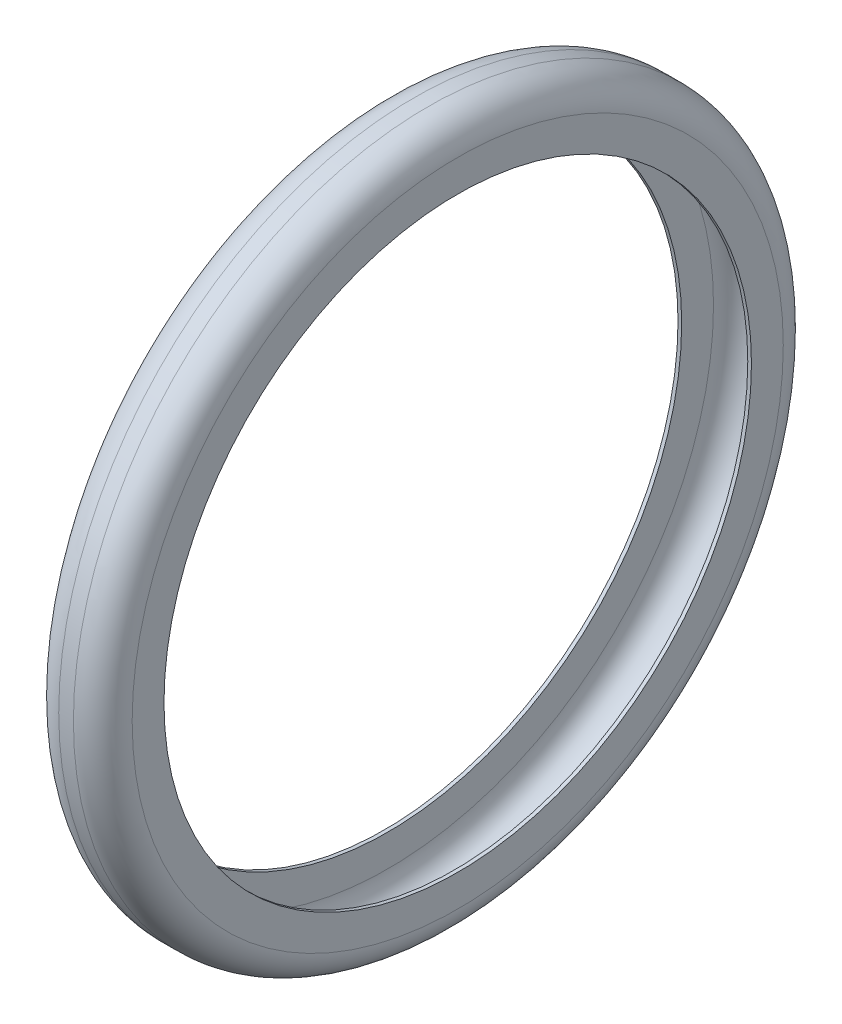
ISO-10303-21;
HEADER;
FILE_DESCRIPTION(('STEP AP214'),'2;1');
FILE_NAME('part.step','',(''),(''),'','','');
FILE_SCHEMA(('AUTOMOTIVE_DESIGN { 1 0 10303 214 1 1 1 1 }'));
ENDSEC;
DATA;
#1=APPLICATION_CONTEXT('core data for automotive mechanical design processes');
#2=APPLICATION_PROTOCOL_DEFINITION('international standard','automotive_design',2000,#1);
#3=PRODUCT_CONTEXT('',#1,'mechanical');
#4=PRODUCT('Part','Part','',(#3));
#5=PRODUCT_RELATED_PRODUCT_CATEGORY('part','',(#4));
#6=PRODUCT_DEFINITION_FORMATION('','',#4);
#7=PRODUCT_DEFINITION_CONTEXT('part definition',#1,'design');
#8=PRODUCT_DEFINITION('design','',#6,#7);
#9=PRODUCT_DEFINITION_SHAPE('','',#8);
#10=(LENGTH_UNIT() NAMED_UNIT(*) SI_UNIT(.MILLI.,.METRE.));
#11=(NAMED_UNIT(*) PLANE_ANGLE_UNIT() SI_UNIT($,.RADIAN.));
#12=(NAMED_UNIT(*) SI_UNIT($,.STERADIAN.) SOLID_ANGLE_UNIT());
#13=UNCERTAINTY_MEASURE_WITH_UNIT(LENGTH_MEASURE(1.E-05),#10,'distance_accuracy_value','');
#14=(GEOMETRIC_REPRESENTATION_CONTEXT(3) GLOBAL_UNCERTAINTY_ASSIGNED_CONTEXT((#13)) GLOBAL_UNIT_ASSIGNED_CONTEXT((#10,
#11,#12)) REPRESENTATION_CONTEXT('',''));
#15=CARTESIAN_POINT('',(0.,0.,0.));
#16=DIRECTION('',(0.,0.,1.));
#17=DIRECTION('',(1.,0.,0.));
#18=AXIS2_PLACEMENT_3D('',#15,#16,#17);
#19=CARTESIAN_POINT('',(60.,0.,0.));
#20=DIRECTION('',(-1.,0.,0.));
#21=DIRECTION('',(0.,0.,1.));
#22=AXIS2_PLACEMENT_3D('',#19,#20,#21);
#23=CYLINDRICAL_SURFACE('',#22,240.);
#24=CARTESIAN_POINT('',(0.,0.,0.));
#25=DIRECTION('',(1.,0.,0.));
#26=DIRECTION('',(0.,0.,-1.));
#27=AXIS2_PLACEMENT_3D('',#24,#25,#26);
#28=CIRCLE('',#27,240.);
#29=CARTESIAN_POINT('',(0.,0.,-240.));
#30=VERTEX_POINT('',#29);
#31=EDGE_CURVE('E53',#30,#30,#28,.T.);
#32=ORIENTED_EDGE('',*,*,#31,.F.);
#33=EDGE_LOOP('',(#32));
#34=FACE_BOUND('',#33,.T.);
#35=CARTESIAN_POINT('',(3.,0.,0.));
#36=DIRECTION('',(1.,0.,0.));
#37=DIRECTION('',(0.,0.,-1.));
#38=AXIS2_PLACEMENT_3D('',#35,#36,#37);
#39=CIRCLE('',#38,240.);
#40=CARTESIAN_POINT('',(3.,0.,-240.));
#41=VERTEX_POINT('',#40);
#42=EDGE_CURVE('E59',#41,#41,#39,.T.);
#43=ORIENTED_EDGE('',*,*,#42,.T.);
#44=EDGE_LOOP('',(#43));
#45=FACE_BOUND('',#44,.T.);
#46=ADVANCED_FACE('F32',(#34,#45),#23,.F.);
#47=CARTESIAN_POINT('',(60.,0.,0.));
#48=DIRECTION('',(1.,0.,0.));
#49=DIRECTION('',(0.,0.,-1.));
#50=AXIS2_PLACEMENT_3D('',#47,#48,#49);
#51=PLANE('',#50);
#52=CARTESIAN_POINT('',(60.,0.,0.));
#53=DIRECTION('',(1.,0.,0.));
#54=DIRECTION('',(0.,0.,-1.));
#55=AXIS2_PLACEMENT_3D('',#52,#53,#54);
#56=CIRCLE('',#55,266.);
#57=CARTESIAN_POINT('',(60.,0.,-266.));
#58=VERTEX_POINT('',#57);
#59=EDGE_CURVE('E10',#58,#58,#56,.T.);
#60=ORIENTED_EDGE('',*,*,#59,.T.);
#61=EDGE_LOOP('',(#60));
#62=FACE_BOUND('',#61,.T.);
#63=CARTESIAN_POINT('',(60.,0.,0.));
#64=DIRECTION('',(1.,0.,0.));
#65=DIRECTION('',(0.,0.,-1.));
#66=AXIS2_PLACEMENT_3D('',#63,#64,#65);
#67=CIRCLE('',#66,240.);
#68=CARTESIAN_POINT('',(60.,0.,-240.));
#69=VERTEX_POINT('',#68);
#70=EDGE_CURVE('E52',#69,#69,#67,.T.);
#71=ORIENTED_EDGE('',*,*,#70,.F.);
#72=EDGE_LOOP('',(#71));
#73=FACE_BOUND('',#72,.T.);
#74=ADVANCED_FACE('F94',(#62,#73),#51,.T.);
#75=CARTESIAN_POINT('',(0.,0.,0.));
#76=DIRECTION('',(1.,0.,0.));
#77=DIRECTION('',(0.,0.,-1.));
#78=AXIS2_PLACEMENT_3D('',#75,#76,#77);
#79=PLANE('',#78);
#80=CARTESIAN_POINT('',(0.,0.,0.));
#81=DIRECTION('',(1.,0.,0.));
#82=DIRECTION('',(0.,0.,-1.));
#83=AXIS2_PLACEMENT_3D('',#80,#81,#82);
#84=CIRCLE('',#83,266.);
#85=CARTESIAN_POINT('',(0.,0.,-266.));
#86=VERTEX_POINT('',#85);
#87=EDGE_CURVE('E39',#86,#86,#84,.F.);
#88=ORIENTED_EDGE('',*,*,#87,.T.);
#89=EDGE_LOOP('',(#88));
#90=FACE_BOUND('',#89,.T.);
#91=ORIENTED_EDGE('',*,*,#31,.T.);
#92=EDGE_LOOP('',(#91));
#93=FACE_BOUND('',#92,.T.);
#94=ADVANCED_FACE('F96',(#90,#93),#79,.F.);
#95=CARTESIAN_POINT('',(60.,0.,0.));
#96=DIRECTION('',(-1.,0.,0.));
#97=DIRECTION('',(0.,0.,1.));
#98=AXIS2_PLACEMENT_3D('',#95,#96,#97);
#99=CYLINDRICAL_SURFACE('',#98,290.);
#100=CARTESIAN_POINT('',(24.,0.,0.));
#101=DIRECTION('',(1.,0.,0.));
#102=DIRECTION('',(0.,0.,-1.));
#103=AXIS2_PLACEMENT_3D('',#100,#101,#102);
#104=CIRCLE('',#103,290.);
#105=CARTESIAN_POINT('',(24.,0.,-290.));
#106=VERTEX_POINT('',#105);
#107=EDGE_CURVE('E43',#106,#106,#104,.T.);
#108=ORIENTED_EDGE('',*,*,#107,.T.);
#109=EDGE_LOOP('',(#108));
#110=FACE_BOUND('',#109,.T.);
#111=CARTESIAN_POINT('',(36.,0.,0.));
#112=DIRECTION('',(1.,0.,0.));
#113=DIRECTION('',(0.,0.,-1.));
#114=AXIS2_PLACEMENT_3D('',#111,#112,#113);
#115=CIRCLE('',#114,290.);
#116=CARTESIAN_POINT('',(36.,0.,-290.));
#117=VERTEX_POINT('',#116);
#118=EDGE_CURVE('E47',#117,#117,#115,.F.);
#119=ORIENTED_EDGE('',*,*,#118,.T.);
#120=EDGE_LOOP('',(#119));
#121=FACE_BOUND('',#120,.T.);
#122=ADVANCED_FACE('F90',(#110,#121),#99,.T.);
#123=CARTESIAN_POINT('',(57.,0.,0.));
#124=DIRECTION('',(1.,0.,0.));
#125=DIRECTION('',(0.,0.,-1.));
#126=AXIS2_PLACEMENT_3D('',#123,#124,#125);
#127=CIRCLE('',#126,240.);
#128=CARTESIAN_POINT('',(57.,0.,-240.));
#129=VERTEX_POINT('',#128);
#130=EDGE_CURVE('E62',#129,#129,#127,.T.);
#131=ORIENTED_EDGE('',*,*,#130,.F.);
#132=EDGE_LOOP('',(#131));
#133=FACE_BOUND('',#132,.T.);
#134=ORIENTED_EDGE('',*,*,#70,.T.);
#135=EDGE_LOOP('',(#134));
#136=FACE_BOUND('',#135,.T.);
#137=ADVANCED_FACE('F86',(#133,#136),#23,.F.);
#138=CARTESIAN_POINT('',(24.,0.,0.));
#139=DIRECTION('',(1.,0.,0.));
#140=DIRECTION('',(0.,0.,-1.));
#141=AXIS2_PLACEMENT_3D('',#138,#139,#140);
#142=TOROIDAL_SURFACE('',#141,266.,24.);
#143=ORIENTED_EDGE('',*,*,#87,.F.);
#144=EDGE_LOOP('',(#143));
#145=FACE_BOUND('',#144,.T.);
#146=ORIENTED_EDGE('',*,*,#107,.F.);
#147=EDGE_LOOP('',(#146));
#148=FACE_BOUND('',#147,.T.);
#149=ADVANCED_FACE('F89',(#145,#148),#142,.T.);
#150=CARTESIAN_POINT('',(36.,0.,0.));
#151=DIRECTION('',(1.,0.,0.));
#152=DIRECTION('',(0.,0.,-1.));
#153=AXIS2_PLACEMENT_3D('',#150,#151,#152);
#154=TOROIDAL_SURFACE('',#153,266.,24.);
#155=ORIENTED_EDGE('',*,*,#118,.F.);
#156=EDGE_LOOP('',(#155));
#157=FACE_BOUND('',#156,.T.);
#158=ORIENTED_EDGE('',*,*,#59,.F.);
#159=EDGE_LOOP('',(#158));
#160=FACE_BOUND('',#159,.T.);
#161=ADVANCED_FACE('F34',(#157,#160),#154,.T.);
#162=CARTESIAN_POINT('',(57.,0.,0.));
#163=DIRECTION('',(1.,0.,0.));
#164=DIRECTION('',(0.,0.,-1.));
#165=AXIS2_PLACEMENT_3D('',#162,#163,#164);
#166=PLANE('',#165);
#167=CARTESIAN_POINT('',(57.,0.,0.));
#168=DIRECTION('',(1.,0.,0.));
#169=DIRECTION('',(0.,0.,-1.));
#170=AXIS2_PLACEMENT_3D('',#167,#168,#169);
#171=CIRCLE('',#170,266.);
#172=CARTESIAN_POINT('',(57.,0.,-266.));
#173=VERTEX_POINT('',#172);
#174=EDGE_CURVE('E56',#173,#173,#171,.T.);
#175=ORIENTED_EDGE('',*,*,#174,.F.);
#176=EDGE_LOOP('',(#175));
#177=FACE_BOUND('',#176,.T.);
#178=ORIENTED_EDGE('',*,*,#130,.T.);
#179=EDGE_LOOP('',(#178));
#180=FACE_BOUND('',#179,.T.);
#181=ADVANCED_FACE('F79',(#177,#180),#166,.F.);
#182=CARTESIAN_POINT('',(3.,0.,0.));
#183=DIRECTION('',(1.,0.,0.));
#184=DIRECTION('',(0.,0.,-1.));
#185=AXIS2_PLACEMENT_3D('',#182,#183,#184);
#186=PLANE('',#185);
#187=CARTESIAN_POINT('',(3.,0.,0.));
#188=DIRECTION('',(1.,0.,0.));
#189=DIRECTION('',(0.,0.,-1.));
#190=AXIS2_PLACEMENT_3D('',#187,#188,#189);
#191=CIRCLE('',#190,266.);
#192=CARTESIAN_POINT('',(3.,0.,-266.));
#193=VERTEX_POINT('',#192);
#194=EDGE_CURVE('E66',#193,#193,#191,.F.);
#195=ORIENTED_EDGE('',*,*,#194,.F.);
#196=EDGE_LOOP('',(#195));
#197=FACE_BOUND('',#196,.T.);
#198=ORIENTED_EDGE('',*,*,#42,.F.);
#199=EDGE_LOOP('',(#198));
#200=FACE_BOUND('',#199,.T.);
#201=ADVANCED_FACE('F82',(#197,#200),#186,.T.);
#202=CARTESIAN_POINT('',(60.,0.,0.));
#203=DIRECTION('',(-1.,0.,0.));
#204=DIRECTION('',(0.,0.,1.));
#205=AXIS2_PLACEMENT_3D('',#202,#203,#204);
#206=CYLINDRICAL_SURFACE('',#205,287.);
#207=CARTESIAN_POINT('',(24.,0.,0.));
#208=DIRECTION('',(-1.,0.,0.));
#209=DIRECTION('',(0.,0.,1.));
#210=AXIS2_PLACEMENT_3D('',#207,#208,#209);
#211=CIRCLE('',#210,287.);
#212=CARTESIAN_POINT('',(24.,0.,287.));
#213=VERTEX_POINT('',#212);
#214=EDGE_CURVE('E69',#213,#213,#211,.F.);
#215=ORIENTED_EDGE('',*,*,#214,.F.);
#216=EDGE_LOOP('',(#215));
#217=FACE_BOUND('',#216,.T.);
#218=CARTESIAN_POINT('',(36.,0.,0.));
#219=DIRECTION('',(-1.,0.,0.));
#220=DIRECTION('',(0.,0.,1.));
#221=AXIS2_PLACEMENT_3D('',#218,#219,#220);
#222=CIRCLE('',#221,287.);
#223=CARTESIAN_POINT('',(36.,0.,287.));
#224=VERTEX_POINT('',#223);
#225=EDGE_CURVE('E65',#224,#224,#222,.T.);
#226=ORIENTED_EDGE('',*,*,#225,.F.);
#227=EDGE_LOOP('',(#226));
#228=FACE_BOUND('',#227,.T.);
#229=ADVANCED_FACE('F133',(#217,#228),#206,.F.);
#230=CARTESIAN_POINT('',(24.,0.,0.));
#231=DIRECTION('',(1.,0.,0.));
#232=DIRECTION('',(0.,0.,-1.));
#233=AXIS2_PLACEMENT_3D('',#230,#231,#232);
#234=TOROIDAL_SURFACE('',#233,266.,21.);
#235=ORIENTED_EDGE('',*,*,#194,.T.);
#236=EDGE_LOOP('',(#235));
#237=FACE_BOUND('',#236,.T.);
#238=ORIENTED_EDGE('',*,*,#214,.T.);
#239=EDGE_LOOP('',(#238));
#240=FACE_BOUND('',#239,.T.);
#241=ADVANCED_FACE('F141',(#237,#240),#234,.F.);
#242=CARTESIAN_POINT('',(36.,0.,0.));
#243=DIRECTION('',(1.,0.,0.));
#244=DIRECTION('',(0.,0.,-1.));
#245=AXIS2_PLACEMENT_3D('',#242,#243,#244);
#246=TOROIDAL_SURFACE('',#245,266.,21.);
#247=ORIENTED_EDGE('',*,*,#225,.T.);
#248=EDGE_LOOP('',(#247));
#249=FACE_BOUND('',#248,.T.);
#250=ORIENTED_EDGE('',*,*,#174,.T.);
#251=EDGE_LOOP('',(#250));
#252=FACE_BOUND('',#251,.T.);
#253=ADVANCED_FACE('F77',(#249,#252),#246,.F.);
#254=CLOSED_SHELL('',(#46,#74,#94,#122,#137,#149,#161,#181,#201,#229,#241,#253));
#255=MANIFOLD_SOLID_BREP('B2',#254);
#256=ADVANCED_BREP_SHAPE_REPRESENTATION('',(#18,#255),#14);
#257=SHAPE_DEFINITION_REPRESENTATION(#9,#256);
ENDSEC;
END-ISO-10303-21;
